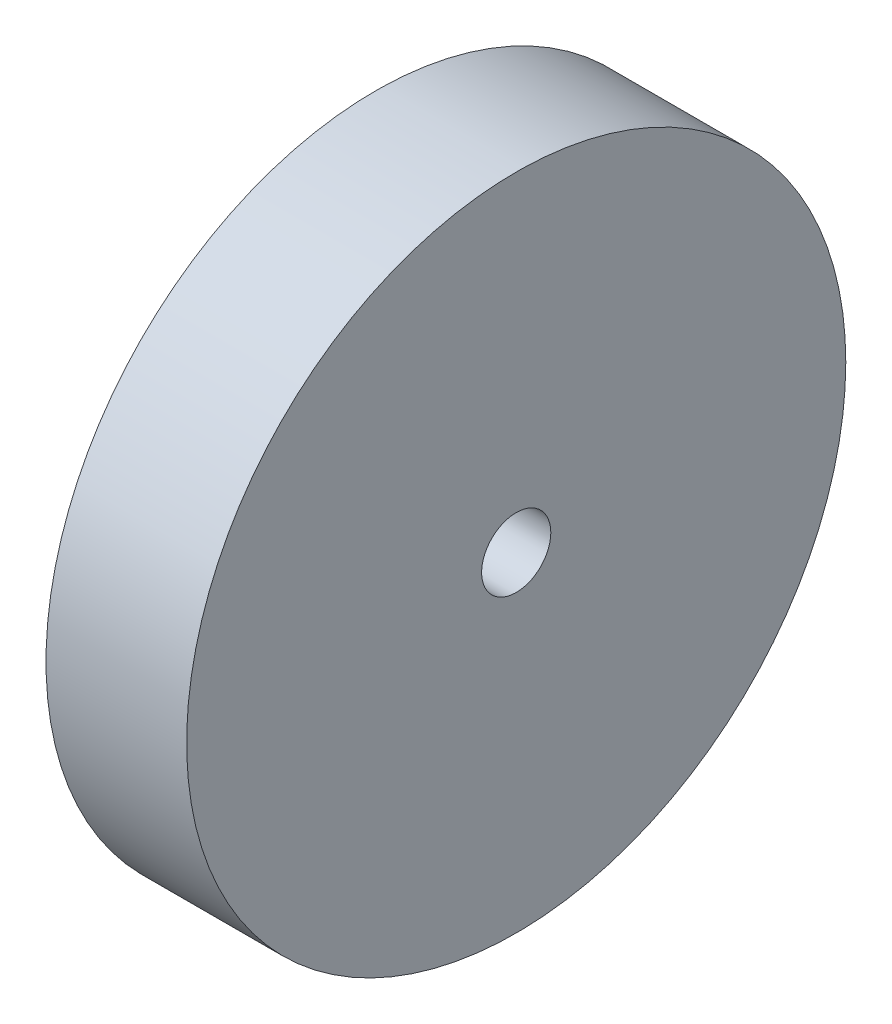
ISO-10303-21;
HEADER;
FILE_DESCRIPTION(('STEP AP214'),'2;1');
FILE_NAME('part.step','',(''),(''),'','','');
FILE_SCHEMA(('AUTOMOTIVE_DESIGN { 1 0 10303 214 1 1 1 1 }'));
ENDSEC;
DATA;
#1=APPLICATION_CONTEXT('core data for automotive mechanical design processes');
#2=APPLICATION_PROTOCOL_DEFINITION('international standard','automotive_design',2000,#1);
#3=PRODUCT_CONTEXT('',#1,'mechanical');
#4=PRODUCT('Part','Part','',(#3));
#5=PRODUCT_RELATED_PRODUCT_CATEGORY('part','',(#4));
#6=PRODUCT_DEFINITION_FORMATION('','',#4);
#7=PRODUCT_DEFINITION_CONTEXT('part definition',#1,'design');
#8=PRODUCT_DEFINITION('design','',#6,#7);
#9=PRODUCT_DEFINITION_SHAPE('','',#8);
#10=(LENGTH_UNIT() NAMED_UNIT(*) SI_UNIT(.MILLI.,.METRE.));
#11=(NAMED_UNIT(*) PLANE_ANGLE_UNIT() SI_UNIT($,.RADIAN.));
#12=(NAMED_UNIT(*) SI_UNIT($,.STERADIAN.) SOLID_ANGLE_UNIT());
#13=UNCERTAINTY_MEASURE_WITH_UNIT(LENGTH_MEASURE(1.E-05),#10,'distance_accuracy_value','');
#14=(GEOMETRIC_REPRESENTATION_CONTEXT(3) GLOBAL_UNCERTAINTY_ASSIGNED_CONTEXT((#13)) GLOBAL_UNIT_ASSIGNED_CONTEXT((#10,
#11,#12)) REPRESENTATION_CONTEXT('',''));
#15=CARTESIAN_POINT('',(0.,0.,0.));
#16=DIRECTION('',(0.,0.,1.));
#17=DIRECTION('',(1.,0.,0.));
#18=AXIS2_PLACEMENT_3D('',#15,#16,#17);
#19=CARTESIAN_POINT('',(5.08,0.,0.));
#20=DIRECTION('',(1.,0.,0.));
#21=DIRECTION('',(0.,0.,-1.));
#22=AXIS2_PLACEMENT_3D('',#19,#20,#21);
#23=PLANE('',#22);
#24=CARTESIAN_POINT('',(5.08,0.,0.));
#25=DIRECTION('',(1.,0.,0.));
#26=DIRECTION('',(0.,0.,-1.));
#27=AXIS2_PLACEMENT_3D('',#24,#25,#26);
#28=CIRCLE('',#27,23.8125);
#29=CARTESIAN_POINT('',(5.08,0.,-23.8125));
#30=VERTEX_POINT('',#29);
#31=EDGE_CURVE('E10',#30,#30,#28,.T.);
#32=ORIENTED_EDGE('',*,*,#31,.T.);
#33=EDGE_LOOP('',(#32));
#34=FACE_BOUND('',#33,.T.);
#35=CARTESIAN_POINT('',(5.08,0.,0.));
#36=DIRECTION('',(1.,0.,0.));
#37=DIRECTION('',(0.,0.,-1.));
#38=AXIS2_PLACEMENT_3D('',#35,#36,#37);
#39=CIRCLE('',#38,2.5);
#40=CARTESIAN_POINT('',(5.08,0.,-2.5));
#41=VERTEX_POINT('',#40);
#42=EDGE_CURVE('E43',#41,#41,#39,.T.);
#43=ORIENTED_EDGE('',*,*,#42,.F.);
#44=EDGE_LOOP('',(#43));
#45=FACE_BOUND('',#44,.T.);
#46=ADVANCED_FACE('F32',(#34,#45),#23,.T.);
#47=CARTESIAN_POINT('',(-5.08,0.,0.));
#48=DIRECTION('',(1.,0.,0.));
#49=DIRECTION('',(0.,0.,-1.));
#50=AXIS2_PLACEMENT_3D('',#47,#48,#49);
#51=PLANE('',#50);
#52=CARTESIAN_POINT('',(-5.08,0.,0.));
#53=DIRECTION('',(1.,0.,0.));
#54=DIRECTION('',(0.,0.,-1.));
#55=AXIS2_PLACEMENT_3D('',#52,#53,#54);
#56=CIRCLE('',#55,23.8125);
#57=CARTESIAN_POINT('',(-5.08,0.,-23.8125));
#58=VERTEX_POINT('',#57);
#59=EDGE_CURVE('E36',#58,#58,#56,.T.);
#60=ORIENTED_EDGE('',*,*,#59,.F.);
#61=EDGE_LOOP('',(#60));
#62=FACE_BOUND('',#61,.T.);
#63=CARTESIAN_POINT('',(-5.08,0.,0.));
#64=DIRECTION('',(1.,0.,0.));
#65=DIRECTION('',(0.,0.,-1.));
#66=AXIS2_PLACEMENT_3D('',#63,#64,#65);
#67=CIRCLE('',#66,2.5);
#68=CARTESIAN_POINT('',(-5.08,0.,-2.5));
#69=VERTEX_POINT('',#68);
#70=EDGE_CURVE('E45',#69,#69,#67,.T.);
#71=ORIENTED_EDGE('',*,*,#70,.T.);
#72=EDGE_LOOP('',(#71));
#73=FACE_BOUND('',#72,.T.);
#74=ADVANCED_FACE('F55',(#62,#73),#51,.F.);
#75=CARTESIAN_POINT('',(5.08,0.,0.));
#76=DIRECTION('',(-1.,0.,0.));
#77=DIRECTION('',(0.,0.,1.));
#78=AXIS2_PLACEMENT_3D('',#75,#76,#77);
#79=CYLINDRICAL_SURFACE('',#78,23.8125);
#80=ORIENTED_EDGE('',*,*,#31,.F.);
#81=EDGE_LOOP('',(#80));
#82=FACE_BOUND('',#81,.T.);
#83=ORIENTED_EDGE('',*,*,#59,.T.);
#84=EDGE_LOOP('',(#83));
#85=FACE_BOUND('',#84,.T.);
#86=ADVANCED_FACE('F34',(#82,#85),#79,.T.);
#87=CARTESIAN_POINT('',(5.08,0.,0.));
#88=DIRECTION('',(-1.,0.,0.));
#89=DIRECTION('',(0.,0.,1.));
#90=AXIS2_PLACEMENT_3D('',#87,#88,#89);
#91=CYLINDRICAL_SURFACE('',#90,2.5);
#92=ORIENTED_EDGE('',*,*,#42,.T.);
#93=EDGE_LOOP('',(#92));
#94=FACE_BOUND('',#93,.T.);
#95=ORIENTED_EDGE('',*,*,#70,.F.);
#96=EDGE_LOOP('',(#95));
#97=FACE_BOUND('',#96,.T.);
#98=ADVANCED_FACE('F51',(#94,#97),#91,.F.);
#99=CLOSED_SHELL('',(#46,#74,#86,#98));
#100=MANIFOLD_SOLID_BREP('B2',#99);
#101=ADVANCED_BREP_SHAPE_REPRESENTATION('',(#18,#100),#14);
#102=SHAPE_DEFINITION_REPRESENTATION(#9,#101);
ENDSEC;
END-ISO-10303-21;
